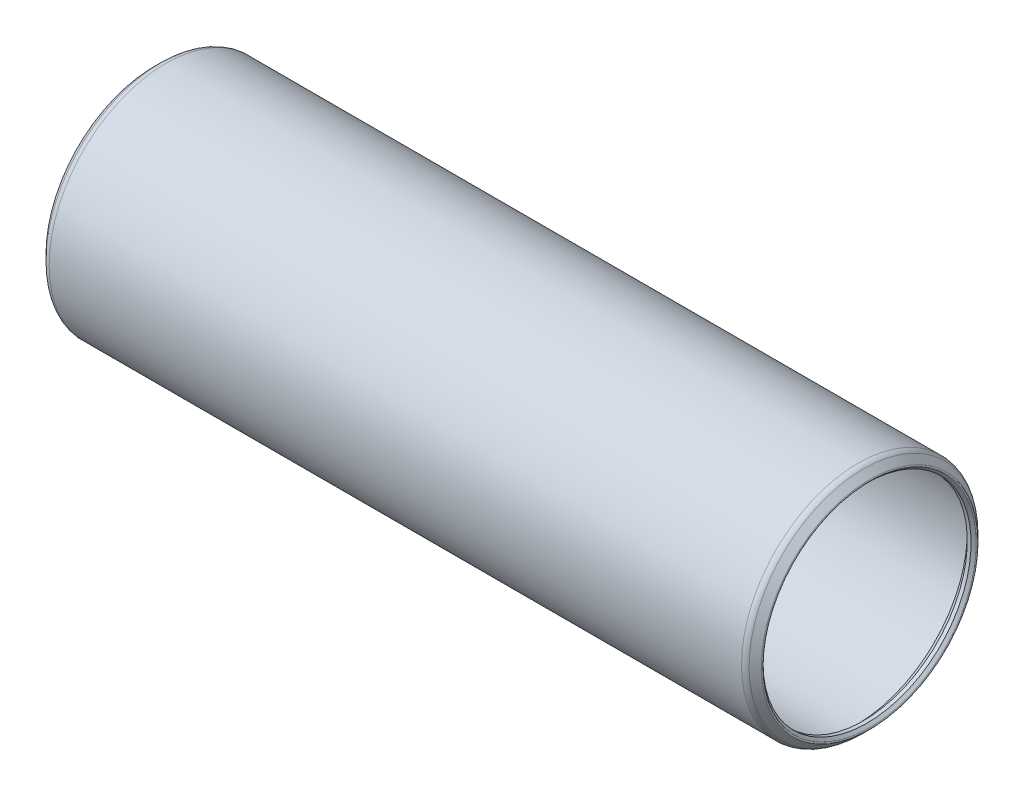
ISO-10303-21;
HEADER;
FILE_DESCRIPTION(('STEP AP214'),'2;1');
FILE_NAME('part.step','',(''),(''),'','','');
FILE_SCHEMA(('AUTOMOTIVE_DESIGN { 1 0 10303 214 1 1 1 1 }'));
ENDSEC;
DATA;
#1=APPLICATION_CONTEXT('core data for automotive mechanical design processes');
#2=APPLICATION_PROTOCOL_DEFINITION('international standard','automotive_design',2000,#1);
#3=PRODUCT_CONTEXT('',#1,'mechanical');
#4=PRODUCT('Part','Part','',(#3));
#5=PRODUCT_RELATED_PRODUCT_CATEGORY('part','',(#4));
#6=PRODUCT_DEFINITION_FORMATION('','',#4);
#7=PRODUCT_DEFINITION_CONTEXT('part definition',#1,'design');
#8=PRODUCT_DEFINITION('design','',#6,#7);
#9=PRODUCT_DEFINITION_SHAPE('','',#8);
#10=(LENGTH_UNIT() NAMED_UNIT(*) SI_UNIT(.MILLI.,.METRE.));
#11=(NAMED_UNIT(*) PLANE_ANGLE_UNIT() SI_UNIT($,.RADIAN.));
#12=(NAMED_UNIT(*) SI_UNIT($,.STERADIAN.) SOLID_ANGLE_UNIT());
#13=UNCERTAINTY_MEASURE_WITH_UNIT(LENGTH_MEASURE(1.E-05),#10,'distance_accuracy_value','');
#14=(GEOMETRIC_REPRESENTATION_CONTEXT(3) GLOBAL_UNCERTAINTY_ASSIGNED_CONTEXT((#13)) GLOBAL_UNIT_ASSIGNED_CONTEXT((#10,
#11,#12)) REPRESENTATION_CONTEXT('',''));
#15=CARTESIAN_POINT('',(0.,0.,0.));
#16=DIRECTION('',(0.,0.,1.));
#17=DIRECTION('',(1.,0.,0.));
#18=AXIS2_PLACEMENT_3D('',#15,#16,#17);
#19=CARTESIAN_POINT('',(-0.549710244842029,0.,0.));
#20=DIRECTION('',(-1.,0.,0.));
#21=DIRECTION('',(0.,0.,1.));
#22=AXIS2_PLACEMENT_3D('',#19,#20,#21);
#23=TOROIDAL_SURFACE('',#22,10.832165367264,0.127000000000741);
#24=CARTESIAN_POINT('',(-0.639512806053455,0.,0.));
#25=DIRECTION('',(-1.,0.,0.));
#26=DIRECTION('',(0.,0.,1.));
#27=AXIS2_PLACEMENT_3D('',#24,#25,#26);
#28=CIRCLE('',#27,10.742362806053);
#29=CARTESIAN_POINT('',(-0.639512806053455,0.,10.742362806053));
#30=VERTEX_POINT('',#29);
#31=EDGE_CURVE('E10',#30,#30,#28,.T.);
#32=ORIENTED_EDGE('',*,*,#31,.F.);
#33=EDGE_LOOP('',(#32));
#34=FACE_BOUND('',#33,.T.);
#35=CARTESIAN_POINT('',(-0.639512806053455,0.,0.));
#36=DIRECTION('',(-1.,0.,0.));
#37=DIRECTION('',(0.,0.,1.));
#38=AXIS2_PLACEMENT_3D('',#35,#36,#37);
#39=CIRCLE('',#38,10.921967928475);
#40=CARTESIAN_POINT('',(-0.639512806053455,0.,10.921967928475));
#41=VERTEX_POINT('',#40);
#42=EDGE_CURVE('E78',#41,#41,#39,.T.);
#43=ORIENTED_EDGE('',*,*,#42,.T.);
#44=EDGE_LOOP('',(#43));
#45=FACE_BOUND('',#44,.T.);
#46=ADVANCED_FACE('F32',(#34,#45),#23,.T.);
#47=CARTESIAN_POINT('',(-0.639512806053455,0.,0.));
#48=DIRECTION('',(-1.,0.,0.));
#49=DIRECTION('',(0.,0.,1.));
#50=AXIS2_PLACEMENT_3D('',#47,#48,#49);
#51=CONICAL_SURFACE('',#50,10.742362806053,0.785398163396579);
#52=CARTESIAN_POINT('',(-0.381000000000006,0.,0.));
#53=DIRECTION('',(-1.,0.,0.));
#54=DIRECTION('',(0.,0.,1.));
#55=AXIS2_PLACEMENT_3D('',#52,#53,#54);
#56=CIRCLE('',#55,10.48385);
#57=CARTESIAN_POINT('',(-0.381000000000006,0.,10.48385));
#58=VERTEX_POINT('',#57);
#59=EDGE_CURVE('E38',#58,#58,#56,.T.);
#60=ORIENTED_EDGE('',*,*,#59,.F.);
#61=EDGE_LOOP('',(#60));
#62=FACE_BOUND('',#61,.T.);
#63=ORIENTED_EDGE('',*,*,#31,.T.);
#64=EDGE_LOOP('',(#63));
#65=FACE_BOUND('',#64,.T.);
#66=ADVANCED_FACE('F151',(#62,#65),#51,.F.);
#67=CARTESIAN_POINT('',(70.8152,0.,0.));
#68=DIRECTION('',(-1.,0.,0.));
#69=DIRECTION('',(0.,0.,1.));
#70=AXIS2_PLACEMENT_3D('',#67,#68,#69);
#71=CYLINDRICAL_SURFACE('',#70,10.48385);
#72=CARTESIAN_POINT('',(0.,0.,0.));
#73=DIRECTION('',(-1.,0.,0.));
#74=DIRECTION('',(0.,0.,1.));
#75=AXIS2_PLACEMENT_3D('',#72,#73,#74);
#76=CIRCLE('',#75,10.48385);
#77=CARTESIAN_POINT('',(0.,0.,10.48385));
#78=VERTEX_POINT('',#77);
#79=EDGE_CURVE('E42',#78,#78,#76,.T.);
#80=ORIENTED_EDGE('',*,*,#79,.F.);
#81=EDGE_LOOP('',(#80));
#82=FACE_BOUND('',#81,.T.);
#83=ORIENTED_EDGE('',*,*,#59,.T.);
#84=EDGE_LOOP('',(#83));
#85=FACE_BOUND('',#84,.T.);
#86=ADVANCED_FACE('F146',(#82,#85),#71,.F.);
#87=CARTESIAN_POINT('',(0.,0.,0.));
#88=DIRECTION('',(1.,0.,0.));
#89=DIRECTION('',(0.,0.,-1.));
#90=AXIS2_PLACEMENT_3D('',#87,#88,#89);
#91=CONICAL_SURFACE('',#90,10.48385,0.78539816339745);
#92=CARTESIAN_POINT('',(0.761999999999999,0.,0.));
#93=DIRECTION('',(-1.,0.,0.));
#94=DIRECTION('',(0.,0.,1.));
#95=AXIS2_PLACEMENT_3D('',#92,#93,#94);
#96=CIRCLE('',#95,11.24585);
#97=CARTESIAN_POINT('',(0.761999999999999,0.,11.24585));
#98=VERTEX_POINT('',#97);
#99=EDGE_CURVE('E46',#98,#98,#96,.T.);
#100=ORIENTED_EDGE('',*,*,#99,.F.);
#101=EDGE_LOOP('',(#100));
#102=FACE_BOUND('',#101,.T.);
#103=ORIENTED_EDGE('',*,*,#79,.T.);
#104=EDGE_LOOP('',(#103));
#105=FACE_BOUND('',#104,.T.);
#106=ADVANCED_FACE('F140',(#102,#105),#91,.F.);
#107=CARTESIAN_POINT('',(70.8152,0.,0.));
#108=DIRECTION('',(-1.,0.,0.));
#109=DIRECTION('',(0.,0.,1.));
#110=AXIS2_PLACEMENT_3D('',#107,#108,#109);
#111=CYLINDRICAL_SURFACE('',#110,11.24585);
#112=CARTESIAN_POINT('',(70.0532,0.,0.));
#113=DIRECTION('',(-1.,0.,0.));
#114=DIRECTION('',(0.,0.,1.));
#115=AXIS2_PLACEMENT_3D('',#112,#113,#114);
#116=CIRCLE('',#115,11.24585);
#117=CARTESIAN_POINT('',(70.0532,0.,11.24585));
#118=VERTEX_POINT('',#117);
#119=EDGE_CURVE('E51',#118,#118,#116,.T.);
#120=ORIENTED_EDGE('',*,*,#119,.F.);
#121=EDGE_LOOP('',(#120));
#122=FACE_BOUND('',#121,.T.);
#123=ORIENTED_EDGE('',*,*,#99,.T.);
#124=EDGE_LOOP('',(#123));
#125=FACE_BOUND('',#124,.T.);
#126=ADVANCED_FACE('F134',(#122,#125),#111,.F.);
#127=CARTESIAN_POINT('',(70.0532,0.,0.));
#128=DIRECTION('',(-1.,0.,0.));
#129=DIRECTION('',(0.,0.,1.));
#130=AXIS2_PLACEMENT_3D('',#127,#128,#129);
#131=CONICAL_SURFACE('',#130,11.24585,0.78539816339745);
#132=CARTESIAN_POINT('',(70.8152,0.,0.));
#133=DIRECTION('',(-1.,0.,0.));
#134=DIRECTION('',(0.,0.,1.));
#135=AXIS2_PLACEMENT_3D('',#132,#133,#134);
#136=CIRCLE('',#135,10.48385);
#137=CARTESIAN_POINT('',(70.8152,0.,10.48385));
#138=VERTEX_POINT('',#137);
#139=EDGE_CURVE('E54',#138,#138,#136,.T.);
#140=ORIENTED_EDGE('',*,*,#139,.F.);
#141=EDGE_LOOP('',(#140));
#142=FACE_BOUND('',#141,.T.);
#143=ORIENTED_EDGE('',*,*,#119,.T.);
#144=EDGE_LOOP('',(#143));
#145=FACE_BOUND('',#144,.T.);
#146=ADVANCED_FACE('F128',(#142,#145),#131,.F.);
#147=CARTESIAN_POINT('',(70.8152,0.,0.));
#148=DIRECTION('',(-1.,0.,0.));
#149=DIRECTION('',(0.,0.,1.));
#150=AXIS2_PLACEMENT_3D('',#147,#148,#149);
#151=CYLINDRICAL_SURFACE('',#150,10.48385);
#152=CARTESIAN_POINT('',(71.1962,0.,0.));
#153=DIRECTION('',(-1.,0.,0.));
#154=DIRECTION('',(0.,0.,1.));
#155=AXIS2_PLACEMENT_3D('',#152,#153,#154);
#156=CIRCLE('',#155,10.48385);
#157=CARTESIAN_POINT('',(71.1962,0.,10.48385));
#158=VERTEX_POINT('',#157);
#159=EDGE_CURVE('E57',#158,#158,#156,.T.);
#160=ORIENTED_EDGE('',*,*,#159,.F.);
#161=EDGE_LOOP('',(#160));
#162=FACE_BOUND('',#161,.T.);
#163=ORIENTED_EDGE('',*,*,#139,.T.);
#164=EDGE_LOOP('',(#163));
#165=FACE_BOUND('',#164,.T.);
#166=ADVANCED_FACE('F122',(#162,#165),#151,.F.);
#167=CARTESIAN_POINT('',(71.1962,0.,0.));
#168=DIRECTION('',(1.,0.,0.));
#169=DIRECTION('',(0.,0.,-1.));
#170=AXIS2_PLACEMENT_3D('',#167,#168,#169);
#171=CONICAL_SURFACE('',#170,10.48385,0.785398163397291);
#172=CARTESIAN_POINT('',(71.4547128060541,0.,0.));
#173=DIRECTION('',(-1.,0.,0.));
#174=DIRECTION('',(0.,0.,1.));
#175=AXIS2_PLACEMENT_3D('',#172,#173,#174);
#176=CIRCLE('',#175,10.742362806054);
#177=CARTESIAN_POINT('',(71.4547128060541,0.,10.742362806054));
#178=VERTEX_POINT('',#177);
#179=EDGE_CURVE('E60',#178,#178,#176,.T.);
#180=ORIENTED_EDGE('',*,*,#179,.F.);
#181=EDGE_LOOP('',(#180));
#182=FACE_BOUND('',#181,.T.);
#183=ORIENTED_EDGE('',*,*,#159,.T.);
#184=EDGE_LOOP('',(#183));
#185=FACE_BOUND('',#184,.T.);
#186=ADVANCED_FACE('F116',(#182,#185),#171,.F.);
#187=CARTESIAN_POINT('',(71.364910244844,0.,0.));
#188=DIRECTION('',(-1.,0.,0.));
#189=DIRECTION('',(0.,0.,1.));
#190=AXIS2_PLACEMENT_3D('',#187,#188,#189);
#191=TOROIDAL_SURFACE('',#190,10.832165367264,0.126999999999112);
#192=CARTESIAN_POINT('',(71.4547128060541,0.,0.));
#193=DIRECTION('',(-1.,0.,0.));
#194=DIRECTION('',(0.,0.,1.));
#195=AXIS2_PLACEMENT_3D('',#192,#193,#194);
#196=CIRCLE('',#195,10.9219679284741);
#197=CARTESIAN_POINT('',(71.4547128060541,0.,10.9219679284741));
#198=VERTEX_POINT('',#197);
#199=EDGE_CURVE('E63',#198,#198,#196,.T.);
#200=ORIENTED_EDGE('',*,*,#199,.F.);
#201=EDGE_LOOP('',(#200));
#202=FACE_BOUND('',#201,.T.);
#203=ORIENTED_EDGE('',*,*,#179,.T.);
#204=EDGE_LOOP('',(#203));
#205=FACE_BOUND('',#204,.T.);
#206=ADVANCED_FACE('F110',(#202,#205),#191,.T.);
#207=CARTESIAN_POINT('',(71.4547128060541,0.,0.));
#208=DIRECTION('',(-1.,0.,0.));
#209=DIRECTION('',(0.,0.,1.));
#210=AXIS2_PLACEMENT_3D('',#207,#208,#209);
#211=CONICAL_SURFACE('',#210,10.9219679284741,0.785398163397474);
#212=CARTESIAN_POINT('',(70.8396653672624,0.,0.));
#213=DIRECTION('',(-1.,0.,0.));
#214=DIRECTION('',(0.,0.,1.));
#215=AXIS2_PLACEMENT_3D('',#212,#213,#214);
#216=CIRCLE('',#215,11.5370153672658);
#217=CARTESIAN_POINT('',(70.8396653672624,0.,11.5370153672658));
#218=VERTEX_POINT('',#217);
#219=EDGE_CURVE('E66',#218,#218,#216,.T.);
#220=ORIENTED_EDGE('',*,*,#219,.F.);
#221=EDGE_LOOP('',(#220));
#222=FACE_BOUND('',#221,.T.);
#223=ORIENTED_EDGE('',*,*,#199,.T.);
#224=EDGE_LOOP('',(#223));
#225=FACE_BOUND('',#224,.T.);
#226=ADVANCED_FACE('F104',(#222,#225),#211,.T.);
#227=CARTESIAN_POINT('',(70.3008500000017,0.,0.));
#228=DIRECTION('',(-1.,0.,0.));
#229=DIRECTION('',(0.,0.,1.));
#230=AXIS2_PLACEMENT_3D('',#227,#228,#229);
#231=TOROIDAL_SURFACE('',#230,10.9982000000049,0.761999999995235);
#232=CARTESIAN_POINT('',(70.3008500000017,0.,0.));
#233=DIRECTION('',(-1.,0.,0.));
#234=DIRECTION('',(0.,0.,1.));
#235=AXIS2_PLACEMENT_3D('',#232,#233,#234);
#236=CIRCLE('',#235,11.7602000000002);
#237=CARTESIAN_POINT('',(70.3008500000017,0.,11.7602000000002));
#238=VERTEX_POINT('',#237);
#239=EDGE_CURVE('E69',#238,#238,#236,.T.);
#240=ORIENTED_EDGE('',*,*,#239,.F.);
#241=EDGE_LOOP('',(#240));
#242=FACE_BOUND('',#241,.T.);
#243=ORIENTED_EDGE('',*,*,#219,.T.);
#244=EDGE_LOOP('',(#243));
#245=FACE_BOUND('',#244,.T.);
#246=ADVANCED_FACE('F98',(#242,#245),#231,.T.);
#247=CARTESIAN_POINT('',(70.8152,0.,0.));
#248=DIRECTION('',(-1.,0.,0.));
#249=DIRECTION('',(0.,0.,1.));
#250=AXIS2_PLACEMENT_3D('',#247,#248,#249);
#251=CYLINDRICAL_SURFACE('',#250,11.7602000000002);
#252=CARTESIAN_POINT('',(0.514349999997873,0.,0.));
#253=DIRECTION('',(-1.,0.,0.));
#254=DIRECTION('',(0.,0.,1.));
#255=AXIS2_PLACEMENT_3D('',#252,#253,#254);
#256=CIRCLE('',#255,11.7602000000002);
#257=CARTESIAN_POINT('',(0.514349999997873,0.,11.7602000000002));
#258=VERTEX_POINT('',#257);
#259=EDGE_CURVE('E72',#258,#258,#256,.T.);
#260=ORIENTED_EDGE('',*,*,#259,.F.);
#261=EDGE_LOOP('',(#260));
#262=FACE_BOUND('',#261,.T.);
#263=ORIENTED_EDGE('',*,*,#239,.T.);
#264=EDGE_LOOP('',(#263));
#265=FACE_BOUND('',#264,.T.);
#266=ADVANCED_FACE('F92',(#262,#265),#251,.T.);
#267=CARTESIAN_POINT('',(0.514349999998028,0.,0.));
#268=DIRECTION('',(-1.,0.,0.));
#269=DIRECTION('',(0.,0.,1.));
#270=AXIS2_PLACEMENT_3D('',#267,#268,#269);
#271=TOROIDAL_SURFACE('',#270,10.9982000000051,0.761999999995068);
#272=CARTESIAN_POINT('',(-0.0244653672626521,0.,0.));
#273=DIRECTION('',(-1.,0.,0.));
#274=DIRECTION('',(0.,0.,1.));
#275=AXIS2_PLACEMENT_3D('',#272,#273,#274);
#276=CIRCLE('',#275,11.5370153672658);
#277=CARTESIAN_POINT('',(-0.0244653672626521,0.,11.5370153672658));
#278=VERTEX_POINT('',#277);
#279=EDGE_CURVE('E75',#278,#278,#276,.T.);
#280=ORIENTED_EDGE('',*,*,#279,.F.);
#281=EDGE_LOOP('',(#280));
#282=FACE_BOUND('',#281,.T.);
#283=ORIENTED_EDGE('',*,*,#259,.T.);
#284=EDGE_LOOP('',(#283));
#285=FACE_BOUND('',#284,.T.);
#286=ADVANCED_FACE('F86',(#282,#285),#271,.T.);
#287=CARTESIAN_POINT('',(-0.0244653672626521,0.,0.));
#288=DIRECTION('',(1.,0.,0.));
#289=DIRECTION('',(0.,0.,-1.));
#290=AXIS2_PLACEMENT_3D('',#287,#288,#289);
#291=CONICAL_SURFACE('',#290,11.5370153672658,0.785398163397451);
#292=ORIENTED_EDGE('',*,*,#42,.F.);
#293=EDGE_LOOP('',(#292));
#294=FACE_BOUND('',#293,.T.);
#295=ORIENTED_EDGE('',*,*,#279,.T.);
#296=EDGE_LOOP('',(#295));
#297=FACE_BOUND('',#296,.T.);
#298=ADVANCED_FACE('F83',(#294,#297),#291,.T.);
#299=CLOSED_SHELL('',(#46,#66,#86,#106,#126,#146,#166,#186,#206,#226,#246,#266,#286,#298));
#300=MANIFOLD_SOLID_BREP('B2',#299);
#301=ADVANCED_BREP_SHAPE_REPRESENTATION('',(#18,#300),#14);
#302=SHAPE_DEFINITION_REPRESENTATION(#9,#301);
ENDSEC;
END-ISO-10303-21;
